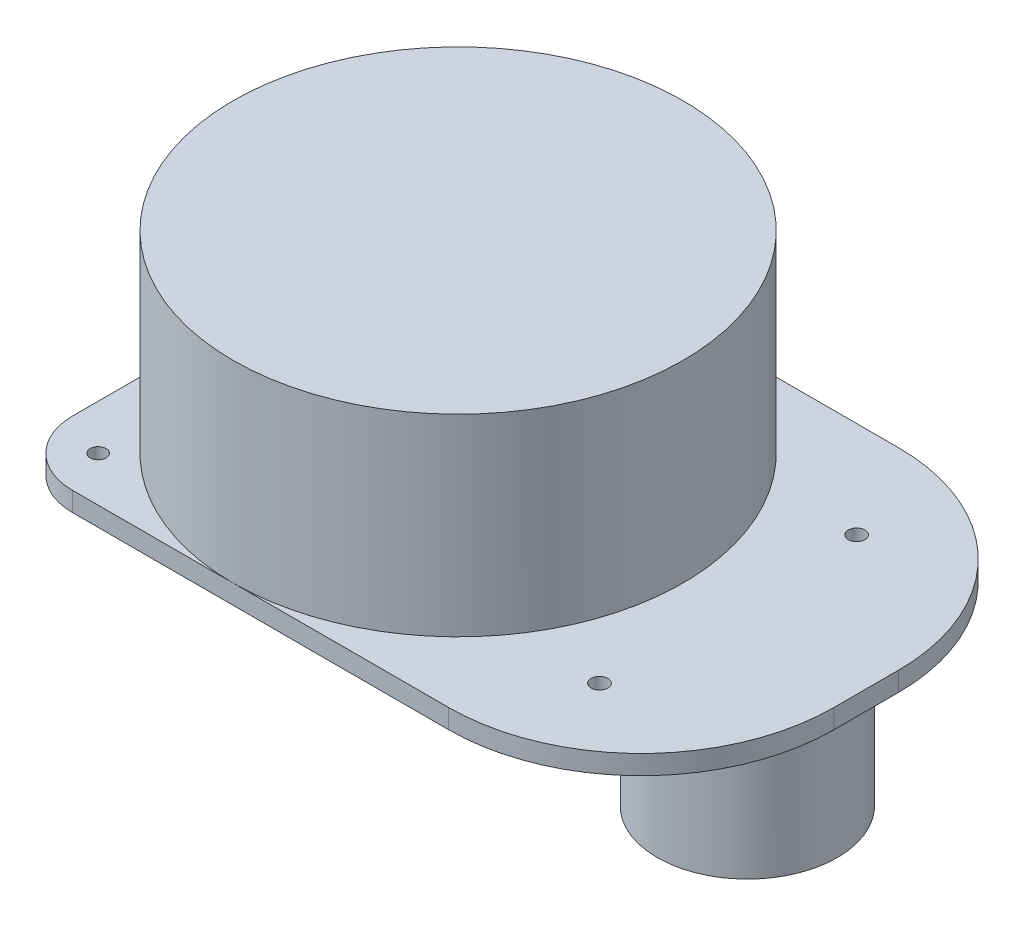
ISO-10303-21;
HEADER;
FILE_DESCRIPTION(('STEP AP214'),'2;1');
FILE_NAME('part.step','',(''),(''),'','','');
FILE_SCHEMA(('AUTOMOTIVE_DESIGN { 1 0 10303 214 1 1 1 1 }'));
ENDSEC;
DATA;
#1=APPLICATION_CONTEXT('core data for automotive mechanical design processes');
#2=APPLICATION_PROTOCOL_DEFINITION('international standard','automotive_design',2000,#1);
#3=PRODUCT_CONTEXT('',#1,'mechanical');
#4=PRODUCT('Part','Part','',(#3));
#5=PRODUCT_RELATED_PRODUCT_CATEGORY('part','',(#4));
#6=PRODUCT_DEFINITION_FORMATION('','',#4);
#7=PRODUCT_DEFINITION_CONTEXT('part definition',#1,'design');
#8=PRODUCT_DEFINITION('design','',#6,#7);
#9=PRODUCT_DEFINITION_SHAPE('','',#8);
#10=(LENGTH_UNIT() NAMED_UNIT(*) SI_UNIT(.MILLI.,.METRE.));
#11=(NAMED_UNIT(*) PLANE_ANGLE_UNIT() SI_UNIT($,.RADIAN.));
#12=(NAMED_UNIT(*) SI_UNIT($,.STERADIAN.) SOLID_ANGLE_UNIT());
#13=UNCERTAINTY_MEASURE_WITH_UNIT(LENGTH_MEASURE(1.E-05),#10,'distance_accuracy_value','');
#14=(GEOMETRIC_REPRESENTATION_CONTEXT(3) GLOBAL_UNCERTAINTY_ASSIGNED_CONTEXT((#13)) GLOBAL_UNIT_ASSIGNED_CONTEXT((#10,
#11,#12)) REPRESENTATION_CONTEXT('',''));
#15=CARTESIAN_POINT('',(0.,0.,0.));
#16=DIRECTION('',(0.,0.,1.));
#17=DIRECTION('',(1.,0.,0.));
#18=AXIS2_PLACEMENT_3D('',#15,#16,#17);
#19=CARTESIAN_POINT('',(0.,-3.,0.));
#20=DIRECTION('',(0.,1.,0.));
#21=DIRECTION('',(0.,0.,1.));
#22=AXIS2_PLACEMENT_3D('',#19,#20,#21);
#23=PLANE('',#22);
#24=DIRECTION('',(0.,0.,1.));
#25=VECTOR('',#24,1.);
#26=CARTESIAN_POINT('',(63.5,-3.,-35.));
#27=LINE('',#26,#25);
#28=CARTESIAN_POINT('',(63.5,-3.,-5.));
#29=VERTEX_POINT('',#28);
#30=CARTESIAN_POINT('',(63.5,-3.,5.));
#31=VERTEX_POINT('',#30);
#32=EDGE_CURVE('E181',#29,#31,#27,.T.);
#33=ORIENTED_EDGE('',*,*,#32,.T.);
#34=CARTESIAN_POINT('',(33.5,-3.,5.));
#35=DIRECTION('',(0.,1.,0.));
#36=DIRECTION('',(0.,0.,1.));
#37=AXIS2_PLACEMENT_3D('',#34,#35,#36);
#38=CIRCLE('',#37,30.);
#39=CARTESIAN_POINT('',(33.5,-3.,35.));
#40=VERTEX_POINT('',#39);
#41=EDGE_CURVE('E41',#31,#40,#38,.F.);
#42=ORIENTED_EDGE('',*,*,#41,.T.);
#43=DIRECTION('',(-1.,0.,0.));
#44=VECTOR('',#43,1.);
#45=CARTESIAN_POINT('',(-35.,-3.,35.));
#46=LINE('',#45,#44);
#47=CARTESIAN_POINT('',(-25.,-3.,35.));
#48=VERTEX_POINT('',#47);
#49=EDGE_CURVE('E133',#40,#48,#46,.T.);
#50=ORIENTED_EDGE('',*,*,#49,.T.);
#51=CARTESIAN_POINT('',(-25.,-3.,25.));
#52=DIRECTION('',(0.,1.,0.));
#53=DIRECTION('',(0.,0.,1.));
#54=AXIS2_PLACEMENT_3D('',#51,#52,#53);
#55=CIRCLE('',#54,10.);
#56=CARTESIAN_POINT('',(-35.,-3.,25.));
#57=VERTEX_POINT('',#56);
#58=EDGE_CURVE('E158',#48,#57,#55,.F.);
#59=ORIENTED_EDGE('',*,*,#58,.T.);
#60=DIRECTION('',(0.,0.,-1.));
#61=VECTOR('',#60,1.);
#62=CARTESIAN_POINT('',(-35.,-3.,-35.));
#63=LINE('',#62,#61);
#64=CARTESIAN_POINT('',(-35.,-3.,-25.));
#65=VERTEX_POINT('',#64);
#66=EDGE_CURVE('E244',#57,#65,#63,.T.);
#67=ORIENTED_EDGE('',*,*,#66,.T.);
#68=CARTESIAN_POINT('',(-25.,-3.,-25.));
#69=DIRECTION('',(0.,1.,0.));
#70=DIRECTION('',(0.,0.,1.));
#71=AXIS2_PLACEMENT_3D('',#68,#69,#70);
#72=CIRCLE('',#71,10.);
#73=CARTESIAN_POINT('',(-25.,-3.,-35.));
#74=VERTEX_POINT('',#73);
#75=EDGE_CURVE('E156',#65,#74,#72,.F.);
#76=ORIENTED_EDGE('',*,*,#75,.T.);
#77=DIRECTION('',(1.,0.,0.));
#78=VECTOR('',#77,1.);
#79=CARTESIAN_POINT('',(-35.,-3.,-35.));
#80=LINE('',#79,#78);
#81=CARTESIAN_POINT('',(33.5,-3.,-35.));
#82=VERTEX_POINT('',#81);
#83=EDGE_CURVE('E242',#74,#82,#80,.T.);
#84=ORIENTED_EDGE('',*,*,#83,.T.);
#85=CARTESIAN_POINT('',(33.5,-3.,-5.));
#86=DIRECTION('',(0.,1.,0.));
#87=DIRECTION('',(0.,0.,1.));
#88=AXIS2_PLACEMENT_3D('',#85,#86,#87);
#89=CIRCLE('',#88,30.);
#90=EDGE_CURVE('E171',#82,#29,#89,.F.);
#91=ORIENTED_EDGE('',*,*,#90,.T.);
#92=EDGE_LOOP('',(#33,#42,#50,#59,#67,#76,#84,#91));
#93=FACE_BOUND('',#92,.T.);
#94=CARTESIAN_POINT('',(-28.,-3.,-28.));
#95=DIRECTION('',(0.,1.,0.));
#96=DIRECTION('',(0.,0.,1.));
#97=AXIS2_PLACEMENT_3D('',#94,#95,#96);
#98=CIRCLE('',#97,1.3);
#99=CARTESIAN_POINT('',(-28.,-3.,-26.7));
#100=VERTEX_POINT('',#99);
#101=EDGE_CURVE('E142',#100,#100,#98,.T.);
#102=ORIENTED_EDGE('',*,*,#101,.T.);
#103=EDGE_LOOP('',(#102));
#104=FACE_BOUND('',#103,.T.);
#105=CARTESIAN_POINT('',(-28.,-3.,28.0042095104704));
#106=DIRECTION('',(0.,1.,0.));
#107=DIRECTION('',(0.,0.,1.));
#108=AXIS2_PLACEMENT_3D('',#105,#106,#107);
#109=CIRCLE('',#108,1.25284849223607);
#110=CARTESIAN_POINT('',(-28.,-3.,29.2570580027065));
#111=VERTEX_POINT('',#110);
#112=EDGE_CURVE('E260',#111,#111,#109,.T.);
#113=ORIENTED_EDGE('',*,*,#112,.T.);
#114=EDGE_LOOP('',(#113));
#115=FACE_BOUND('',#114,.T.);
#116=CARTESIAN_POINT('',(42.,-3.,-20.));
#117=DIRECTION('',(0.,1.,0.));
#118=DIRECTION('',(0.,0.,1.));
#119=AXIS2_PLACEMENT_3D('',#116,#117,#118);
#120=CIRCLE('',#119,1.3);
#121=CARTESIAN_POINT('',(42.,-3.,-18.7));
#122=VERTEX_POINT('',#121);
#123=EDGE_CURVE('E266',#122,#122,#120,.T.);
#124=ORIENTED_EDGE('',*,*,#123,.T.);
#125=EDGE_LOOP('',(#124));
#126=FACE_BOUND('',#125,.T.);
#127=CARTESIAN_POINT('',(42.,-3.,20.));
#128=DIRECTION('',(0.,1.,0.));
#129=DIRECTION('',(0.,0.,1.));
#130=AXIS2_PLACEMENT_3D('',#127,#128,#129);
#131=CIRCLE('',#130,1.3);
#132=CARTESIAN_POINT('',(42.,-3.,21.3));
#133=VERTEX_POINT('',#132);
#134=EDGE_CURVE('E272',#133,#133,#131,.T.);
#135=ORIENTED_EDGE('',*,*,#134,.T.);
#136=EDGE_LOOP('',(#135));
#137=FACE_BOUND('',#136,.T.);
#138=CARTESIAN_POINT('',(45.000000000008,-3.,0.));
#139=DIRECTION('',(0.,1.,0.));
#140=DIRECTION('',(0.,0.,1.));
#141=AXIS2_PLACEMENT_3D('',#138,#139,#140);
#142=CIRCLE('',#141,14.);
#143=CARTESIAN_POINT('',(45.000000000008,-3.,14.));
#144=VERTEX_POINT('',#143);
#145=EDGE_CURVE('E11',#144,#144,#142,.F.);
#146=ORIENTED_EDGE('',*,*,#145,.F.);
#147=EDGE_LOOP('',(#146));
#148=FACE_BOUND('',#147,.T.);
#149=ADVANCED_FACE('F33',(#93,#104,#115,#126,#137,#148),#23,.F.);
#150=CARTESIAN_POINT('',(0.,30.,0.));
#151=DIRECTION('',(0.,-1.,0.));
#152=DIRECTION('',(0.,0.,-1.));
#153=AXIS2_PLACEMENT_3D('',#150,#151,#152);
#154=CYLINDRICAL_SURFACE('',#153,35.);
#155=CARTESIAN_POINT('',(0.,30.,0.));
#156=DIRECTION('',(0.,1.,0.));
#157=DIRECTION('',(0.,0.,1.));
#158=AXIS2_PLACEMENT_3D('',#155,#156,#157);
#159=CIRCLE('',#158,35.);
#160=CARTESIAN_POINT('',(0.,30.,35.));
#161=VERTEX_POINT('',#160);
#162=EDGE_CURVE('E144',#161,#161,#159,.T.);
#163=ORIENTED_EDGE('',*,*,#162,.F.);
#164=EDGE_LOOP('',(#163));
#165=FACE_BOUND('',#164,.T.);
#166=CARTESIAN_POINT('',(0.,0.,0.));
#167=DIRECTION('',(0.,1.,0.));
#168=DIRECTION('',(0.,0.,1.));
#169=AXIS2_PLACEMENT_3D('',#166,#167,#168);
#170=CIRCLE('',#169,35.);
#171=CARTESIAN_POINT('',(0.,0.,35.));
#172=VERTEX_POINT('',#171);
#173=CARTESIAN_POINT('',(0.,0.,-35.));
#174=VERTEX_POINT('',#173);
#175=EDGE_CURVE('E135',#172,#174,#170,.T.);
#176=ORIENTED_EDGE('',*,*,#175,.T.);
#177=CARTESIAN_POINT('',(-35.,0.,0.));
#178=VERTEX_POINT('',#177);
#179=EDGE_CURVE('E132',#174,#178,#170,.T.);
#180=ORIENTED_EDGE('',*,*,#179,.T.);
#181=EDGE_CURVE('E124',#178,#172,#170,.T.);
#182=ORIENTED_EDGE('',*,*,#181,.T.);
#183=EDGE_LOOP('',(#176,#180,#182));
#184=FACE_BOUND('',#183,.T.);
#185=ADVANCED_FACE('F143',(#165,#184),#154,.T.);
#186=CARTESIAN_POINT('',(0.,30.,0.));
#187=DIRECTION('',(0.,1.,0.));
#188=DIRECTION('',(0.,0.,1.));
#189=AXIS2_PLACEMENT_3D('',#186,#187,#188);
#190=PLANE('',#189);
#191=ORIENTED_EDGE('',*,*,#162,.T.);
#192=EDGE_LOOP('',(#191));
#193=FACE_BOUND('',#192,.T.);
#194=ADVANCED_FACE('F206',(#193),#190,.T.);
#195=CARTESIAN_POINT('',(0.,0.,0.));
#196=DIRECTION('',(0.,1.,0.));
#197=DIRECTION('',(0.,0.,1.));
#198=AXIS2_PLACEMENT_3D('',#195,#196,#197);
#199=PLANE('',#198);
#200=CARTESIAN_POINT('',(42.,0.,20.));
#201=DIRECTION('',(0.,1.,0.));
#202=DIRECTION('',(0.,0.,1.));
#203=AXIS2_PLACEMENT_3D('',#200,#201,#202);
#204=CIRCLE('',#203,1.3);
#205=CARTESIAN_POINT('',(42.,0.,21.3));
#206=VERTEX_POINT('',#205);
#207=EDGE_CURVE('E275',#206,#206,#204,.T.);
#208=ORIENTED_EDGE('',*,*,#207,.F.);
#209=EDGE_LOOP('',(#208));
#210=FACE_BOUND('',#209,.T.);
#211=CARTESIAN_POINT('',(42.,0.,-20.));
#212=DIRECTION('',(0.,1.,0.));
#213=DIRECTION('',(0.,0.,1.));
#214=AXIS2_PLACEMENT_3D('',#211,#212,#213);
#215=CIRCLE('',#214,1.3);
#216=CARTESIAN_POINT('',(42.,0.,-18.7));
#217=VERTEX_POINT('',#216);
#218=EDGE_CURVE('E269',#217,#217,#215,.T.);
#219=ORIENTED_EDGE('',*,*,#218,.F.);
#220=EDGE_LOOP('',(#219));
#221=FACE_BOUND('',#220,.T.);
#222=DIRECTION('',(-1.,0.,0.));
#223=VECTOR('',#222,1.);
#224=CARTESIAN_POINT('',(-35.,0.,35.));
#225=LINE('',#224,#223);
#226=CARTESIAN_POINT('',(33.5,0.,35.));
#227=VERTEX_POINT('',#226);
#228=EDGE_CURVE('E249',#227,#172,#225,.T.);
#229=ORIENTED_EDGE('',*,*,#228,.F.);
#230=CARTESIAN_POINT('',(33.5,0.,5.));
#231=DIRECTION('',(0.,1.,0.));
#232=DIRECTION('',(0.,0.,1.));
#233=AXIS2_PLACEMENT_3D('',#230,#231,#232);
#234=CIRCLE('',#233,30.);
#235=CARTESIAN_POINT('',(63.5,0.,5.));
#236=VERTEX_POINT('',#235);
#237=EDGE_CURVE('E56',#227,#236,#234,.T.);
#238=ORIENTED_EDGE('',*,*,#237,.T.);
#239=DIRECTION('',(0.,0.,1.));
#240=VECTOR('',#239,1.);
#241=CARTESIAN_POINT('',(63.5,0.,-35.));
#242=LINE('',#241,#240);
#243=CARTESIAN_POINT('',(63.5,0.,-5.));
#244=VERTEX_POINT('',#243);
#245=EDGE_CURVE('E255',#244,#236,#242,.T.);
#246=ORIENTED_EDGE('',*,*,#245,.F.);
#247=CARTESIAN_POINT('',(33.5,0.,-5.));
#248=DIRECTION('',(0.,1.,0.));
#249=DIRECTION('',(0.,0.,1.));
#250=AXIS2_PLACEMENT_3D('',#247,#248,#249);
#251=CIRCLE('',#250,30.);
#252=CARTESIAN_POINT('',(33.5,0.,-35.));
#253=VERTEX_POINT('',#252);
#254=EDGE_CURVE('E167',#244,#253,#251,.T.);
#255=ORIENTED_EDGE('',*,*,#254,.T.);
#256=DIRECTION('',(1.,0.,0.));
#257=VECTOR('',#256,1.);
#258=CARTESIAN_POINT('',(-35.,0.,-35.));
#259=LINE('',#258,#257);
#260=EDGE_CURVE('E120',#174,#253,#259,.T.);
#261=ORIENTED_EDGE('',*,*,#260,.F.);
#262=ORIENTED_EDGE('',*,*,#175,.F.);
#263=EDGE_LOOP('',(#229,#238,#246,#255,#261,#262));
#264=FACE_BOUND('',#263,.T.);
#265=ADVANCED_FACE('F211',(#210,#221,#264),#199,.T.);
#266=CARTESIAN_POINT('',(-28.,0.,-28.));
#267=DIRECTION('',(0.,1.,0.));
#268=DIRECTION('',(0.,0.,1.));
#269=AXIS2_PLACEMENT_3D('',#266,#267,#268);
#270=CIRCLE('',#269,1.3);
#271=CARTESIAN_POINT('',(-28.,0.,-26.7));
#272=VERTEX_POINT('',#271);
#273=EDGE_CURVE('E257',#272,#272,#270,.T.);
#274=ORIENTED_EDGE('',*,*,#273,.F.);
#275=EDGE_LOOP('',(#274));
#276=FACE_BOUND('',#275,.T.);
#277=CARTESIAN_POINT('',(-25.,0.,-35.));
#278=VERTEX_POINT('',#277);
#279=EDGE_CURVE('E253',#278,#174,#259,.T.);
#280=ORIENTED_EDGE('',*,*,#279,.F.);
#281=CARTESIAN_POINT('',(-25.,0.,-25.));
#282=DIRECTION('',(0.,1.,0.));
#283=DIRECTION('',(0.,0.,1.));
#284=AXIS2_PLACEMENT_3D('',#281,#282,#283);
#285=CIRCLE('',#284,10.);
#286=CARTESIAN_POINT('',(-35.,0.,-25.));
#287=VERTEX_POINT('',#286);
#288=EDGE_CURVE('E141',#278,#287,#285,.T.);
#289=ORIENTED_EDGE('',*,*,#288,.T.);
#290=DIRECTION('',(0.,0.,-1.));
#291=VECTOR('',#290,1.);
#292=CARTESIAN_POINT('',(-35.,0.,-35.));
#293=LINE('',#292,#291);
#294=EDGE_CURVE('E115',#178,#287,#293,.T.);
#295=ORIENTED_EDGE('',*,*,#294,.F.);
#296=ORIENTED_EDGE('',*,*,#179,.F.);
#297=EDGE_LOOP('',(#280,#289,#295,#296));
#298=FACE_BOUND('',#297,.T.);
#299=ADVANCED_FACE('F139',(#276,#298),#199,.T.);
#300=CARTESIAN_POINT('',(-28.,0.,28.0042095104704));
#301=DIRECTION('',(0.,1.,0.));
#302=DIRECTION('',(0.,0.,1.));
#303=AXIS2_PLACEMENT_3D('',#300,#301,#302);
#304=CIRCLE('',#303,1.25284849223607);
#305=CARTESIAN_POINT('',(-28.,0.,29.2570580027065));
#306=VERTEX_POINT('',#305);
#307=EDGE_CURVE('E263',#306,#306,#304,.T.);
#308=ORIENTED_EDGE('',*,*,#307,.F.);
#309=EDGE_LOOP('',(#308));
#310=FACE_BOUND('',#309,.T.);
#311=CARTESIAN_POINT('',(-35.,0.,25.));
#312=VERTEX_POINT('',#311);
#313=EDGE_CURVE('E110',#312,#178,#293,.T.);
#314=ORIENTED_EDGE('',*,*,#313,.F.);
#315=CARTESIAN_POINT('',(-25.,0.,25.));
#316=DIRECTION('',(0.,1.,0.));
#317=DIRECTION('',(0.,0.,1.));
#318=AXIS2_PLACEMENT_3D('',#315,#316,#317);
#319=CIRCLE('',#318,10.);
#320=CARTESIAN_POINT('',(-25.,0.,35.));
#321=VERTEX_POINT('',#320);
#322=EDGE_CURVE('E151',#312,#321,#319,.T.);
#323=ORIENTED_EDGE('',*,*,#322,.T.);
#324=EDGE_CURVE('E127',#172,#321,#225,.T.);
#325=ORIENTED_EDGE('',*,*,#324,.F.);
#326=ORIENTED_EDGE('',*,*,#181,.F.);
#327=EDGE_LOOP('',(#314,#323,#325,#326));
#328=FACE_BOUND('',#327,.T.);
#329=ADVANCED_FACE('F125',(#310,#328),#199,.T.);
#330=CARTESIAN_POINT('',(-35.,-3.,-35.));
#331=DIRECTION('',(1.,0.,0.));
#332=DIRECTION('',(0.,0.,-1.));
#333=AXIS2_PLACEMENT_3D('',#330,#331,#332);
#334=PLANE('',#333);
#335=ORIENTED_EDGE('',*,*,#66,.F.);
#336=DIRECTION('',(0.,1.,0.));
#337=VECTOR('',#336,1.);
#338=CARTESIAN_POINT('',(-35.,-3.,25.));
#339=LINE('',#338,#337);
#340=EDGE_CURVE('E118',#57,#312,#339,.T.);
#341=ORIENTED_EDGE('',*,*,#340,.T.);
#342=ORIENTED_EDGE('',*,*,#313,.T.);
#343=ORIENTED_EDGE('',*,*,#294,.T.);
#344=DIRECTION('',(0.,1.,0.));
#345=VECTOR('',#344,1.);
#346=CARTESIAN_POINT('',(-35.,-3.,-25.));
#347=LINE('',#346,#345);
#348=EDGE_CURVE('E148',#287,#65,#347,.F.);
#349=ORIENTED_EDGE('',*,*,#348,.T.);
#350=EDGE_LOOP('',(#335,#341,#342,#343,#349));
#351=FACE_BOUND('',#350,.T.);
#352=ADVANCED_FACE('F113',(#351),#334,.F.);
#353=CARTESIAN_POINT('',(-35.,-3.,-35.));
#354=DIRECTION('',(0.,0.,1.));
#355=DIRECTION('',(1.,0.,0.));
#356=AXIS2_PLACEMENT_3D('',#353,#354,#355);
#357=PLANE('',#356);
#358=ORIENTED_EDGE('',*,*,#260,.T.);
#359=DIRECTION('',(0.,1.,0.));
#360=VECTOR('',#359,1.);
#361=CARTESIAN_POINT('',(33.5,-3.,-35.));
#362=LINE('',#361,#360);
#363=EDGE_CURVE('E169',#253,#82,#362,.F.);
#364=ORIENTED_EDGE('',*,*,#363,.T.);
#365=ORIENTED_EDGE('',*,*,#83,.F.);
#366=DIRECTION('',(0.,1.,0.));
#367=VECTOR('',#366,1.);
#368=CARTESIAN_POINT('',(-25.,-3.,-35.));
#369=LINE('',#368,#367);
#370=EDGE_CURVE('E160',#74,#278,#369,.T.);
#371=ORIENTED_EDGE('',*,*,#370,.T.);
#372=ORIENTED_EDGE('',*,*,#279,.T.);
#373=EDGE_LOOP('',(#358,#364,#365,#371,#372));
#374=FACE_BOUND('',#373,.T.);
#375=ADVANCED_FACE('F221',(#374),#357,.F.);
#376=CARTESIAN_POINT('',(63.5,-3.,-35.));
#377=DIRECTION('',(-1.,0.,0.));
#378=DIRECTION('',(0.,0.,1.));
#379=AXIS2_PLACEMENT_3D('',#376,#377,#378);
#380=PLANE('',#379);
#381=ORIENTED_EDGE('',*,*,#245,.T.);
#382=DIRECTION('',(0.,1.,0.));
#383=VECTOR('',#382,1.);
#384=CARTESIAN_POINT('',(63.5,-3.,5.));
#385=LINE('',#384,#383);
#386=EDGE_CURVE('E48',#236,#31,#385,.F.);
#387=ORIENTED_EDGE('',*,*,#386,.T.);
#388=ORIENTED_EDGE('',*,*,#32,.F.);
#389=DIRECTION('',(0.,1.,0.));
#390=VECTOR('',#389,1.);
#391=CARTESIAN_POINT('',(63.5,-3.,-5.));
#392=LINE('',#391,#390);
#393=EDGE_CURVE('E164',#29,#244,#392,.T.);
#394=ORIENTED_EDGE('',*,*,#393,.T.);
#395=EDGE_LOOP('',(#381,#387,#388,#394));
#396=FACE_BOUND('',#395,.T.);
#397=ADVANCED_FACE('F218',(#396),#380,.F.);
#398=CARTESIAN_POINT('',(-35.,-3.,35.));
#399=DIRECTION('',(0.,0.,-1.));
#400=DIRECTION('',(-1.,0.,0.));
#401=AXIS2_PLACEMENT_3D('',#398,#399,#400);
#402=PLANE('',#401);
#403=ORIENTED_EDGE('',*,*,#49,.F.);
#404=DIRECTION('',(0.,1.,0.));
#405=VECTOR('',#404,1.);
#406=CARTESIAN_POINT('',(33.5,-3.,35.));
#407=LINE('',#406,#405);
#408=EDGE_CURVE('E173',#40,#227,#407,.T.);
#409=ORIENTED_EDGE('',*,*,#408,.T.);
#410=ORIENTED_EDGE('',*,*,#228,.T.);
#411=ORIENTED_EDGE('',*,*,#324,.T.);
#412=DIRECTION('',(0.,1.,0.));
#413=VECTOR('',#412,1.);
#414=CARTESIAN_POINT('',(-25.,-3.,35.));
#415=LINE('',#414,#413);
#416=EDGE_CURVE('E153',#321,#48,#415,.F.);
#417=ORIENTED_EDGE('',*,*,#416,.T.);
#418=EDGE_LOOP('',(#403,#409,#410,#411,#417));
#419=FACE_BOUND('',#418,.T.);
#420=ADVANCED_FACE('F185',(#419),#402,.F.);
#421=CARTESIAN_POINT('',(-25.,-3.,25.));
#422=DIRECTION('',(0.,1.,0.));
#423=DIRECTION('',(0.,0.,1.));
#424=AXIS2_PLACEMENT_3D('',#421,#422,#423);
#425=CYLINDRICAL_SURFACE('',#424,10.);
#426=ORIENTED_EDGE('',*,*,#58,.F.);
#427=ORIENTED_EDGE('',*,*,#416,.F.);
#428=ORIENTED_EDGE('',*,*,#322,.F.);
#429=ORIENTED_EDGE('',*,*,#340,.F.);
#430=EDGE_LOOP('',(#426,#427,#428,#429));
#431=FACE_BOUND('',#430,.T.);
#432=ADVANCED_FACE('F217',(#431),#425,.T.);
#433=CARTESIAN_POINT('',(-25.,-3.,-25.));
#434=DIRECTION('',(0.,1.,0.));
#435=DIRECTION('',(0.,0.,1.));
#436=AXIS2_PLACEMENT_3D('',#433,#434,#435);
#437=CYLINDRICAL_SURFACE('',#436,10.);
#438=ORIENTED_EDGE('',*,*,#75,.F.);
#439=ORIENTED_EDGE('',*,*,#348,.F.);
#440=ORIENTED_EDGE('',*,*,#288,.F.);
#441=ORIENTED_EDGE('',*,*,#370,.F.);
#442=EDGE_LOOP('',(#438,#439,#440,#441));
#443=FACE_BOUND('',#442,.T.);
#444=ADVANCED_FACE('F199',(#443),#437,.T.);
#445=CARTESIAN_POINT('',(33.5,-3.,-5.));
#446=DIRECTION('',(0.,1.,0.));
#447=DIRECTION('',(0.,0.,1.));
#448=AXIS2_PLACEMENT_3D('',#445,#446,#447);
#449=CYLINDRICAL_SURFACE('',#448,30.);
#450=ORIENTED_EDGE('',*,*,#90,.F.);
#451=ORIENTED_EDGE('',*,*,#363,.F.);
#452=ORIENTED_EDGE('',*,*,#254,.F.);
#453=ORIENTED_EDGE('',*,*,#393,.F.);
#454=EDGE_LOOP('',(#450,#451,#452,#453));
#455=FACE_BOUND('',#454,.T.);
#456=ADVANCED_FACE('F191',(#455),#449,.T.);
#457=CARTESIAN_POINT('',(33.5,-3.,5.));
#458=DIRECTION('',(0.,1.,0.));
#459=DIRECTION('',(0.,0.,1.));
#460=AXIS2_PLACEMENT_3D('',#457,#458,#459);
#461=CYLINDRICAL_SURFACE('',#460,30.);
#462=ORIENTED_EDGE('',*,*,#41,.F.);
#463=ORIENTED_EDGE('',*,*,#386,.F.);
#464=ORIENTED_EDGE('',*,*,#237,.F.);
#465=ORIENTED_EDGE('',*,*,#408,.F.);
#466=EDGE_LOOP('',(#462,#463,#464,#465));
#467=FACE_BOUND('',#466,.T.);
#468=ADVANCED_FACE('F35',(#467),#461,.T.);
#469=CARTESIAN_POINT('',(-28.,-3.,-28.));
#470=DIRECTION('',(0.,1.,0.));
#471=DIRECTION('',(0.,0.,1.));
#472=AXIS2_PLACEMENT_3D('',#469,#470,#471);
#473=CYLINDRICAL_SURFACE('',#472,1.3);
#474=ORIENTED_EDGE('',*,*,#101,.F.);
#475=EDGE_LOOP('',(#474));
#476=FACE_BOUND('',#475,.T.);
#477=ORIENTED_EDGE('',*,*,#273,.T.);
#478=EDGE_LOOP('',(#477));
#479=FACE_BOUND('',#478,.T.);
#480=ADVANCED_FACE('F190',(#476,#479),#473,.F.);
#481=CARTESIAN_POINT('',(-28.,-3.,28.0042095104704));
#482=DIRECTION('',(0.,1.,0.));
#483=DIRECTION('',(0.,0.,1.));
#484=AXIS2_PLACEMENT_3D('',#481,#482,#483);
#485=CYLINDRICAL_SURFACE('',#484,1.25284849223607);
#486=ORIENTED_EDGE('',*,*,#112,.F.);
#487=EDGE_LOOP('',(#486));
#488=FACE_BOUND('',#487,.T.);
#489=ORIENTED_EDGE('',*,*,#307,.T.);
#490=EDGE_LOOP('',(#489));
#491=FACE_BOUND('',#490,.T.);
#492=ADVANCED_FACE('F196',(#488,#491),#485,.F.);
#493=CARTESIAN_POINT('',(42.,-3.,-20.));
#494=DIRECTION('',(0.,1.,0.));
#495=DIRECTION('',(0.,0.,1.));
#496=AXIS2_PLACEMENT_3D('',#493,#494,#495);
#497=CYLINDRICAL_SURFACE('',#496,1.3);
#498=ORIENTED_EDGE('',*,*,#123,.F.);
#499=EDGE_LOOP('',(#498));
#500=FACE_BOUND('',#499,.T.);
#501=ORIENTED_EDGE('',*,*,#218,.T.);
#502=EDGE_LOOP('',(#501));
#503=FACE_BOUND('',#502,.T.);
#504=ADVANCED_FACE('F298',(#500,#503),#497,.F.);
#505=CARTESIAN_POINT('',(42.,-3.,20.));
#506=DIRECTION('',(0.,1.,0.));
#507=DIRECTION('',(0.,0.,1.));
#508=AXIS2_PLACEMENT_3D('',#505,#506,#507);
#509=CYLINDRICAL_SURFACE('',#508,1.3);
#510=ORIENTED_EDGE('',*,*,#134,.F.);
#511=EDGE_LOOP('',(#510));
#512=FACE_BOUND('',#511,.T.);
#513=ORIENTED_EDGE('',*,*,#207,.T.);
#514=EDGE_LOOP('',(#513));
#515=FACE_BOUND('',#514,.T.);
#516=ADVANCED_FACE('F289',(#512,#515),#509,.F.);
#517=CARTESIAN_POINT('',(45.000000000008,-25.,0.));
#518=DIRECTION('',(0.,1.,0.));
#519=DIRECTION('',(0.,0.,1.));
#520=AXIS2_PLACEMENT_3D('',#517,#518,#519);
#521=CYLINDRICAL_SURFACE('',#520,14.);
#522=CARTESIAN_POINT('',(45.000000000008,-25.,0.));
#523=DIRECTION('',(0.,-1.,0.));
#524=DIRECTION('',(0.,0.,-1.));
#525=AXIS2_PLACEMENT_3D('',#522,#523,#524);
#526=CIRCLE('',#525,14.);
#527=CARTESIAN_POINT('',(45.000000000008,-25.,-14.));
#528=VERTEX_POINT('',#527);
#529=EDGE_CURVE('E278',#528,#528,#526,.T.);
#530=ORIENTED_EDGE('',*,*,#529,.F.);
#531=EDGE_LOOP('',(#530));
#532=FACE_BOUND('',#531,.T.);
#533=ORIENTED_EDGE('',*,*,#145,.T.);
#534=EDGE_LOOP('',(#533));
#535=FACE_BOUND('',#534,.T.);
#536=ADVANCED_FACE('F286',(#532,#535),#521,.T.);
#537=CARTESIAN_POINT('',(45.000000000008,-25.,0.));
#538=DIRECTION('',(0.,-1.,0.));
#539=DIRECTION('',(0.,0.,-1.));
#540=AXIS2_PLACEMENT_3D('',#537,#538,#539);
#541=PLANE('',#540);
#542=ORIENTED_EDGE('',*,*,#529,.T.);
#543=EDGE_LOOP('',(#542));
#544=FACE_BOUND('',#543,.T.);
#545=ADVANCED_FACE('F284',(#544),#541,.T.);
#546=CLOSED_SHELL('',(#149,#185,#194,#265,#299,#329,#352,#375,#397,#420,#432,#444,#456,#468,
#480,#492,#504,#516,#536,#545));
#547=MANIFOLD_SOLID_BREP('B2',#546);
#548=ADVANCED_BREP_SHAPE_REPRESENTATION('',(#18,#547),#14);
#549=SHAPE_DEFINITION_REPRESENTATION(#9,#548);
ENDSEC;
END-ISO-10303-21;
